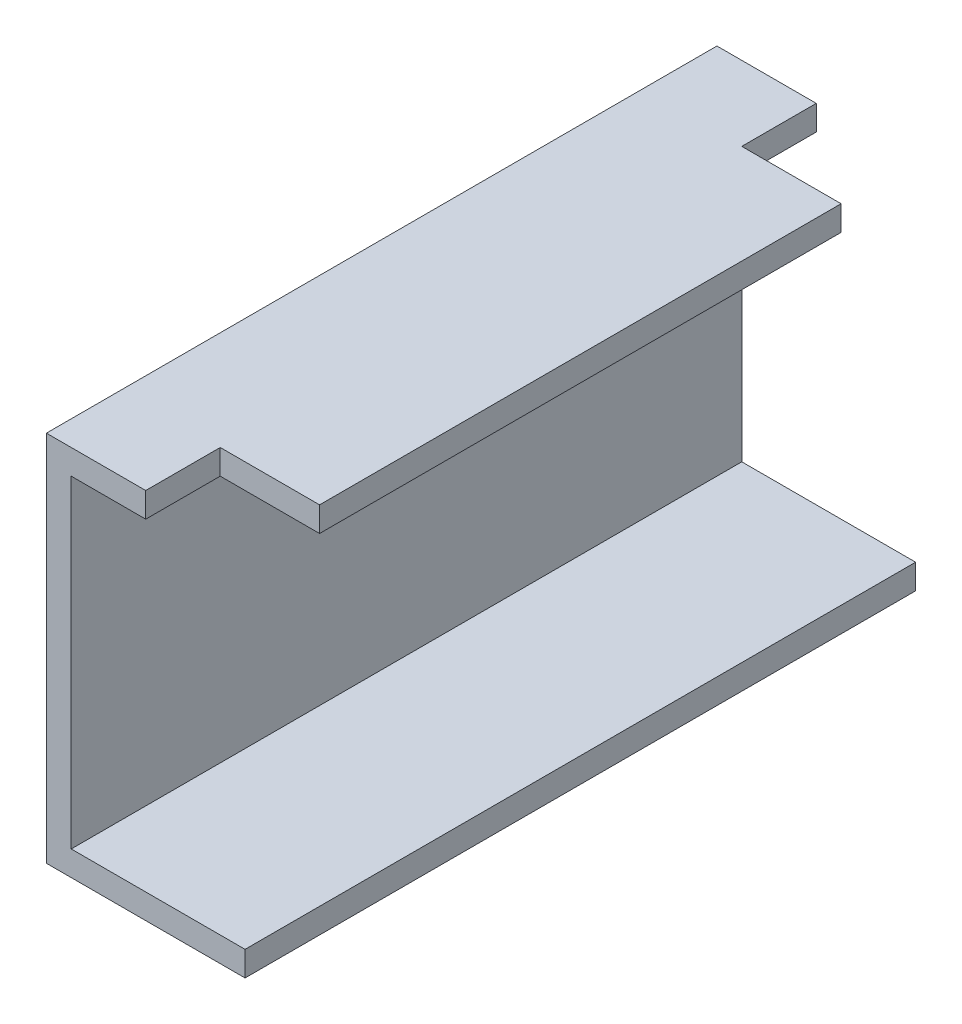
ISO-10303-21;
HEADER;
FILE_DESCRIPTION(('STEP AP214'),'2;1');
FILE_NAME('part.step','',(''),(''),'','','');
FILE_SCHEMA(('AUTOMOTIVE_DESIGN { 1 0 10303 214 1 1 1 1 }'));
ENDSEC;
DATA;
#1=APPLICATION_CONTEXT('core data for automotive mechanical design processes');
#2=APPLICATION_PROTOCOL_DEFINITION('international standard','automotive_design',2000,#1);
#3=PRODUCT_CONTEXT('',#1,'mechanical');
#4=PRODUCT('Part','Part','',(#3));
#5=PRODUCT_RELATED_PRODUCT_CATEGORY('part','',(#4));
#6=PRODUCT_DEFINITION_FORMATION('','',#4);
#7=PRODUCT_DEFINITION_CONTEXT('part definition',#1,'design');
#8=PRODUCT_DEFINITION('design','',#6,#7);
#9=PRODUCT_DEFINITION_SHAPE('','',#8);
#10=(LENGTH_UNIT() NAMED_UNIT(*) SI_UNIT(.MILLI.,.METRE.));
#11=(NAMED_UNIT(*) PLANE_ANGLE_UNIT() SI_UNIT($,.RADIAN.));
#12=(NAMED_UNIT(*) SI_UNIT($,.STERADIAN.) SOLID_ANGLE_UNIT());
#13=UNCERTAINTY_MEASURE_WITH_UNIT(LENGTH_MEASURE(1.E-05),#10,'distance_accuracy_value','');
#14=(GEOMETRIC_REPRESENTATION_CONTEXT(3) GLOBAL_UNCERTAINTY_ASSIGNED_CONTEXT((#13)) GLOBAL_UNIT_ASSIGNED_CONTEXT((#10,
#11,#12)) REPRESENTATION_CONTEXT('',''));
#15=CARTESIAN_POINT('',(0.,0.,0.));
#16=DIRECTION('',(0.,0.,1.));
#17=DIRECTION('',(1.,0.,0.));
#18=AXIS2_PLACEMENT_3D('',#15,#16,#17);
#19=CARTESIAN_POINT('',(-1.1,0.0499999999999997,-0.675));
#20=DIRECTION('',(0.,-1.,0.));
#21=DIRECTION('',(0.,0.,-1.));
#22=AXIS2_PLACEMENT_3D('',#19,#20,#21);
#23=PLANE('',#22);
#24=DIRECTION('',(0.,0.,1.));
#25=VECTOR('',#24,1.);
#26=CARTESIAN_POINT('',(-0.75,0.0499999999999997,-0.675));
#27=LINE('',#26,#25);
#28=CARTESIAN_POINT('',(-0.75,0.0500000000000004,-0.675));
#29=VERTEX_POINT('',#28);
#30=CARTESIAN_POINT('',(-0.75,0.0499999999999997,0.675000000000001));
#31=VERTEX_POINT('',#30);
#32=EDGE_CURVE('E11',#29,#31,#27,.T.);
#33=ORIENTED_EDGE('',*,*,#32,.F.);
#34=DIRECTION('',(1.,0.,0.));
#35=VECTOR('',#34,1.);
#36=CARTESIAN_POINT('',(-1.1,0.0500000000000003,-0.675));
#37=LINE('',#36,#35);
#38=CARTESIAN_POINT('',(-1.1,0.0500000000000003,-0.675));
#39=VERTEX_POINT('',#38);
#40=EDGE_CURVE('E24',#39,#29,#37,.T.);
#41=ORIENTED_EDGE('',*,*,#40,.F.);
#42=DIRECTION('',(0.,0.,-1.));
#43=VECTOR('',#42,1.);
#44=CARTESIAN_POINT('',(-1.1,0.0499999999999997,-0.675));
#45=LINE('',#44,#43);
#46=CARTESIAN_POINT('',(-1.1,0.05,0.675));
#47=VERTEX_POINT('',#46);
#48=EDGE_CURVE('E203',#47,#39,#45,.T.);
#49=ORIENTED_EDGE('',*,*,#48,.F.);
#50=DIRECTION('',(1.,0.,0.));
#51=VECTOR('',#50,1.);
#52=CARTESIAN_POINT('',(-1.1,0.05,0.675));
#53=LINE('',#52,#51);
#54=EDGE_CURVE('E201',#47,#31,#53,.T.);
#55=ORIENTED_EDGE('',*,*,#54,.T.);
#56=EDGE_LOOP('',(#33,#41,#49,#55));
#57=FACE_BOUND('',#56,.T.);
#58=ADVANCED_FACE('F17',(#57),#23,.F.);
#59=CARTESIAN_POINT('',(-1.15,0.,0.675));
#60=DIRECTION('',(0.,1.,0.));
#61=DIRECTION('',(0.,0.,1.));
#62=AXIS2_PLACEMENT_3D('',#59,#60,#61);
#63=PLANE('',#62);
#64=DIRECTION('',(0.,0.,-1.));
#65=VECTOR('',#64,1.);
#66=CARTESIAN_POINT('',(-0.75,0.,0.675));
#67=LINE('',#66,#65);
#68=CARTESIAN_POINT('',(-0.75,0.,0.675));
#69=VERTEX_POINT('',#68);
#70=CARTESIAN_POINT('',(-0.75,0.,-0.675));
#71=VERTEX_POINT('',#70);
#72=EDGE_CURVE('E199',#69,#71,#67,.T.);
#73=ORIENTED_EDGE('',*,*,#72,.F.);
#74=DIRECTION('',(1.,0.,0.));
#75=VECTOR('',#74,1.);
#76=CARTESIAN_POINT('',(-1.15,0.,0.675));
#77=LINE('',#76,#75);
#78=CARTESIAN_POINT('',(-1.15,0.,0.675));
#79=VERTEX_POINT('',#78);
#80=EDGE_CURVE('E196',#79,#69,#77,.T.);
#81=ORIENTED_EDGE('',*,*,#80,.F.);
#82=DIRECTION('',(0.,0.,1.));
#83=VECTOR('',#82,1.);
#84=CARTESIAN_POINT('',(-1.15,0.,0.675));
#85=LINE('',#84,#83);
#86=CARTESIAN_POINT('',(-1.15,0.,-0.675));
#87=VERTEX_POINT('',#86);
#88=EDGE_CURVE('E193',#87,#79,#85,.T.);
#89=ORIENTED_EDGE('',*,*,#88,.F.);
#90=DIRECTION('',(1.,0.,0.));
#91=VECTOR('',#90,1.);
#92=CARTESIAN_POINT('',(-1.15,0.,-0.675));
#93=LINE('',#92,#91);
#94=EDGE_CURVE('E190',#87,#71,#93,.T.);
#95=ORIENTED_EDGE('',*,*,#94,.T.);
#96=EDGE_LOOP('',(#73,#81,#89,#95));
#97=FACE_BOUND('',#96,.T.);
#98=ADVANCED_FACE('F213',(#97),#63,.F.);
#99=CARTESIAN_POINT('',(-1.1,0.7,-0.675));
#100=DIRECTION('',(1.,0.,0.));
#101=DIRECTION('',(0.,0.,-1.));
#102=AXIS2_PLACEMENT_3D('',#99,#100,#101);
#103=PLANE('',#102);
#104=DIRECTION('',(0.,-1.,0.));
#105=VECTOR('',#104,1.);
#106=CARTESIAN_POINT('',(-1.1,0.7,0.675));
#107=LINE('',#106,#105);
#108=CARTESIAN_POINT('',(-1.1,0.7,0.675));
#109=VERTEX_POINT('',#108);
#110=EDGE_CURVE('E187',#109,#47,#107,.T.);
#111=ORIENTED_EDGE('',*,*,#110,.T.);
#112=ORIENTED_EDGE('',*,*,#48,.T.);
#113=DIRECTION('',(0.,-1.,0.));
#114=VECTOR('',#113,1.);
#115=CARTESIAN_POINT('',(-1.1,0.7,-0.675));
#116=LINE('',#115,#114);
#117=CARTESIAN_POINT('',(-1.1,0.7,-0.675));
#118=VERTEX_POINT('',#117);
#119=EDGE_CURVE('E184',#118,#39,#116,.T.);
#120=ORIENTED_EDGE('',*,*,#119,.F.);
#121=DIRECTION('',(0.,0.,1.));
#122=VECTOR('',#121,1.);
#123=CARTESIAN_POINT('',(-1.1,0.7,-0.675));
#124=LINE('',#123,#122);
#125=EDGE_CURVE('E181',#118,#109,#124,.T.);
#126=ORIENTED_EDGE('',*,*,#125,.T.);
#127=EDGE_LOOP('',(#111,#112,#120,#126));
#128=FACE_BOUND('',#127,.T.);
#129=ADVANCED_FACE('F223',(#128),#103,.T.);
#130=CARTESIAN_POINT('',(-1.15,0.75,0.675));
#131=DIRECTION('',(-1.,0.,0.));
#132=DIRECTION('',(0.,0.,1.));
#133=AXIS2_PLACEMENT_3D('',#130,#131,#132);
#134=PLANE('',#133);
#135=DIRECTION('',(0.,-1.,0.));
#136=VECTOR('',#135,1.);
#137=CARTESIAN_POINT('',(-1.15,0.75,-0.675));
#138=LINE('',#137,#136);
#139=CARTESIAN_POINT('',(-1.15,0.75,-0.675));
#140=VERTEX_POINT('',#139);
#141=EDGE_CURVE('E178',#140,#87,#138,.T.);
#142=ORIENTED_EDGE('',*,*,#141,.T.);
#143=ORIENTED_EDGE('',*,*,#88,.T.);
#144=DIRECTION('',(0.,-1.,0.));
#145=VECTOR('',#144,1.);
#146=CARTESIAN_POINT('',(-1.15,0.750000000000001,0.675));
#147=LINE('',#146,#145);
#148=CARTESIAN_POINT('',(-1.15,0.750000000000001,0.675));
#149=VERTEX_POINT('',#148);
#150=EDGE_CURVE('E175',#149,#79,#147,.T.);
#151=ORIENTED_EDGE('',*,*,#150,.F.);
#152=DIRECTION('',(0.,0.,-1.));
#153=VECTOR('',#152,1.);
#154=CARTESIAN_POINT('',(-1.15,0.75,0.675));
#155=LINE('',#154,#153);
#156=EDGE_CURVE('E172',#149,#140,#155,.T.);
#157=ORIENTED_EDGE('',*,*,#156,.T.);
#158=EDGE_LOOP('',(#142,#143,#151,#157));
#159=FACE_BOUND('',#158,.T.);
#160=ADVANCED_FACE('F215',(#159),#134,.T.);
#161=CARTESIAN_POINT('',(-2.47592560861063,0.700000000000001,-0.675));
#162=DIRECTION('',(0.,1.,0.));
#163=DIRECTION('',(-1.,0.,0.));
#164=AXIS2_PLACEMENT_3D('',#161,#162,#163);
#165=PLANE('',#164);
#166=DIRECTION('',(0.,0.,1.));
#167=VECTOR('',#166,1.);
#168=CARTESIAN_POINT('',(-0.75,0.7,-0.675));
#169=LINE('',#168,#167);
#170=CARTESIAN_POINT('',(-0.75,0.7,-0.525));
#171=VERTEX_POINT('',#170);
#172=CARTESIAN_POINT('',(-0.75,0.7,0.525));
#173=VERTEX_POINT('',#172);
#174=EDGE_CURVE('E170',#171,#173,#169,.T.);
#175=ORIENTED_EDGE('',*,*,#174,.T.);
#176=DIRECTION('',(1.,0.,0.));
#177=VECTOR('',#176,1.);
#178=CARTESIAN_POINT('',(-0.75,0.7,0.525));
#179=LINE('',#178,#177);
#180=CARTESIAN_POINT('',(-0.95,0.7,0.525));
#181=VERTEX_POINT('',#180);
#182=EDGE_CURVE('E167',#181,#173,#179,.T.);
#183=ORIENTED_EDGE('',*,*,#182,.F.);
#184=DIRECTION('',(0.,0.,-1.));
#185=VECTOR('',#184,1.);
#186=CARTESIAN_POINT('',(-0.95,0.7,0.675));
#187=LINE('',#186,#185);
#188=CARTESIAN_POINT('',(-0.95,0.7,0.675));
#189=VERTEX_POINT('',#188);
#190=EDGE_CURVE('E164',#189,#181,#187,.T.);
#191=ORIENTED_EDGE('',*,*,#190,.F.);
#192=DIRECTION('',(1.,0.,0.));
#193=VECTOR('',#192,1.);
#194=CARTESIAN_POINT('',(-2.47592560861063,0.700000000000001,0.675));
#195=LINE('',#194,#193);
#196=EDGE_CURVE('E161',#109,#189,#195,.T.);
#197=ORIENTED_EDGE('',*,*,#196,.F.);
#198=ORIENTED_EDGE('',*,*,#125,.F.);
#199=DIRECTION('',(1.,0.,0.));
#200=VECTOR('',#199,1.);
#201=CARTESIAN_POINT('',(-2.47592560861063,0.700000000000001,-0.675));
#202=LINE('',#201,#200);
#203=CARTESIAN_POINT('',(-0.95,0.7,-0.675));
#204=VERTEX_POINT('',#203);
#205=EDGE_CURVE('E159',#118,#204,#202,.T.);
#206=ORIENTED_EDGE('',*,*,#205,.T.);
#207=DIRECTION('',(0.,0.,-1.));
#208=VECTOR('',#207,1.);
#209=CARTESIAN_POINT('',(-0.95,0.7,-0.675));
#210=LINE('',#209,#208);
#211=CARTESIAN_POINT('',(-0.95,0.7,-0.525));
#212=VERTEX_POINT('',#211);
#213=EDGE_CURVE('E157',#212,#204,#210,.T.);
#214=ORIENTED_EDGE('',*,*,#213,.F.);
#215=DIRECTION('',(-1.,0.,0.));
#216=VECTOR('',#215,1.);
#217=CARTESIAN_POINT('',(-0.75,0.7,-0.525));
#218=LINE('',#217,#216);
#219=EDGE_CURVE('E127',#171,#212,#218,.T.);
#220=ORIENTED_EDGE('',*,*,#219,.F.);
#221=EDGE_LOOP('',(#175,#183,#191,#197,#198,#206,#214,#220));
#222=FACE_BOUND('',#221,.T.);
#223=ADVANCED_FACE('F220',(#222),#165,.F.);
#224=CARTESIAN_POINT('',(-2.47592560861063,0.750000000000001,-0.675));
#225=DIRECTION('',(0.,0.,1.));
#226=DIRECTION('',(1.,0.,0.));
#227=AXIS2_PLACEMENT_3D('',#224,#225,#226);
#228=PLANE('',#227);
#229=DIRECTION('',(1.,0.,0.));
#230=VECTOR('',#229,1.);
#231=CARTESIAN_POINT('',(-2.47592560861063,0.750000000000001,-0.675));
#232=LINE('',#231,#230);
#233=CARTESIAN_POINT('',(-0.95,0.75,-0.675));
#234=VERTEX_POINT('',#233);
#235=EDGE_CURVE('E154',#140,#234,#232,.T.);
#236=ORIENTED_EDGE('',*,*,#235,.T.);
#237=DIRECTION('',(0.,1.,0.));
#238=VECTOR('',#237,1.);
#239=CARTESIAN_POINT('',(-0.95,-0.00100000000000057,-0.675));
#240=LINE('',#239,#238);
#241=EDGE_CURVE('E121',#204,#234,#240,.T.);
#242=ORIENTED_EDGE('',*,*,#241,.F.);
#243=ORIENTED_EDGE('',*,*,#205,.F.);
#244=ORIENTED_EDGE('',*,*,#119,.T.);
#245=ORIENTED_EDGE('',*,*,#40,.T.);
#246=DIRECTION('',(0.,1.,0.));
#247=VECTOR('',#246,1.);
#248=CARTESIAN_POINT('',(-0.75,0.375,-0.675));
#249=LINE('',#248,#247);
#250=EDGE_CURVE('E151',#71,#29,#249,.T.);
#251=ORIENTED_EDGE('',*,*,#250,.F.);
#252=ORIENTED_EDGE('',*,*,#94,.F.);
#253=ORIENTED_EDGE('',*,*,#141,.F.);
#254=EDGE_LOOP('',(#236,#242,#243,#244,#245,#251,#252,#253));
#255=FACE_BOUND('',#254,.T.);
#256=ADVANCED_FACE('F207',(#255),#228,.F.);
#257=CARTESIAN_POINT('',(-2.47592560861063,0.750000000000001,0.675));
#258=DIRECTION('',(0.,-1.,0.));
#259=DIRECTION('',(1.,0.,0.));
#260=AXIS2_PLACEMENT_3D('',#257,#258,#259);
#261=PLANE('',#260);
#262=DIRECTION('',(0.,0.,1.));
#263=VECTOR('',#262,1.);
#264=CARTESIAN_POINT('',(-0.95,0.75,0.675));
#265=LINE('',#264,#263);
#266=CARTESIAN_POINT('',(-0.95,0.75,0.525));
#267=VERTEX_POINT('',#266);
#268=CARTESIAN_POINT('',(-0.95,0.75,0.675));
#269=VERTEX_POINT('',#268);
#270=EDGE_CURVE('E149',#267,#269,#265,.T.);
#271=ORIENTED_EDGE('',*,*,#270,.F.);
#272=DIRECTION('',(-1.,0.,0.));
#273=VECTOR('',#272,1.);
#274=CARTESIAN_POINT('',(-0.75,0.75,0.525));
#275=LINE('',#274,#273);
#276=CARTESIAN_POINT('',(-0.75,0.75,0.525));
#277=VERTEX_POINT('',#276);
#278=EDGE_CURVE('E146',#277,#267,#275,.T.);
#279=ORIENTED_EDGE('',*,*,#278,.F.);
#280=DIRECTION('',(0.,0.,-1.));
#281=VECTOR('',#280,1.);
#282=CARTESIAN_POINT('',(-0.75,0.75,0.675));
#283=LINE('',#282,#281);
#284=CARTESIAN_POINT('',(-0.75,0.75,-0.525));
#285=VERTEX_POINT('',#284);
#286=EDGE_CURVE('E108',#277,#285,#283,.T.);
#287=ORIENTED_EDGE('',*,*,#286,.T.);
#288=DIRECTION('',(1.,0.,0.));
#289=VECTOR('',#288,1.);
#290=CARTESIAN_POINT('',(-0.75,0.75,-0.525));
#291=LINE('',#290,#289);
#292=CARTESIAN_POINT('',(-0.95,0.75,-0.525));
#293=VERTEX_POINT('',#292);
#294=EDGE_CURVE('E102',#293,#285,#291,.T.);
#295=ORIENTED_EDGE('',*,*,#294,.F.);
#296=DIRECTION('',(0.,0.,1.));
#297=VECTOR('',#296,1.);
#298=CARTESIAN_POINT('',(-0.95,0.75,-0.675));
#299=LINE('',#298,#297);
#300=EDGE_CURVE('E106',#234,#293,#299,.T.);
#301=ORIENTED_EDGE('',*,*,#300,.F.);
#302=ORIENTED_EDGE('',*,*,#235,.F.);
#303=ORIENTED_EDGE('',*,*,#156,.F.);
#304=DIRECTION('',(1.,0.,0.));
#305=VECTOR('',#304,1.);
#306=CARTESIAN_POINT('',(-2.47592560861063,0.750000000000001,0.675));
#307=LINE('',#306,#305);
#308=EDGE_CURVE('E122',#149,#269,#307,.T.);
#309=ORIENTED_EDGE('',*,*,#308,.T.);
#310=EDGE_LOOP('',(#271,#279,#287,#295,#301,#302,#303,#309));
#311=FACE_BOUND('',#310,.T.);
#312=ADVANCED_FACE('F104',(#311),#261,.F.);
#313=CARTESIAN_POINT('',(-2.47592560861063,0.700000000000001,0.675));
#314=DIRECTION('',(0.,0.,-1.));
#315=DIRECTION('',(0.,1.,0.));
#316=AXIS2_PLACEMENT_3D('',#313,#314,#315);
#317=PLANE('',#316);
#318=ORIENTED_EDGE('',*,*,#196,.T.);
#319=DIRECTION('',(0.,1.,0.));
#320=VECTOR('',#319,1.);
#321=CARTESIAN_POINT('',(-0.95,-0.00100000000000057,0.675));
#322=LINE('',#321,#320);
#323=EDGE_CURVE('E140',#189,#269,#322,.T.);
#324=ORIENTED_EDGE('',*,*,#323,.T.);
#325=ORIENTED_EDGE('',*,*,#308,.F.);
#326=ORIENTED_EDGE('',*,*,#150,.T.);
#327=ORIENTED_EDGE('',*,*,#80,.T.);
#328=DIRECTION('',(0.,-1.,0.));
#329=VECTOR('',#328,1.);
#330=CARTESIAN_POINT('',(-0.75,0.375,0.675000000000001));
#331=LINE('',#330,#329);
#332=EDGE_CURVE('E138',#31,#69,#331,.T.);
#333=ORIENTED_EDGE('',*,*,#332,.F.);
#334=ORIENTED_EDGE('',*,*,#54,.F.);
#335=ORIENTED_EDGE('',*,*,#110,.F.);
#336=EDGE_LOOP('',(#318,#324,#325,#326,#327,#333,#334,#335));
#337=FACE_BOUND('',#336,.T.);
#338=ADVANCED_FACE('F226',(#337),#317,.F.);
#339=CARTESIAN_POINT('',(-0.75,0.75,0.675));
#340=DIRECTION('',(-1.,0.,0.));
#341=DIRECTION('',(0.,0.,1.));
#342=AXIS2_PLACEMENT_3D('',#339,#340,#341);
#343=PLANE('',#342);
#344=ORIENTED_EDGE('',*,*,#286,.F.);
#345=DIRECTION('',(0.,1.,0.));
#346=VECTOR('',#345,1.);
#347=CARTESIAN_POINT('',(-0.75,-0.00100000000000057,0.525));
#348=LINE('',#347,#346);
#349=EDGE_CURVE('E131',#173,#277,#348,.T.);
#350=ORIENTED_EDGE('',*,*,#349,.F.);
#351=ORIENTED_EDGE('',*,*,#174,.F.);
#352=DIRECTION('',(0.,1.,0.));
#353=VECTOR('',#352,1.);
#354=CARTESIAN_POINT('',(-0.75,-0.00100000000000057,-0.525));
#355=LINE('',#354,#353);
#356=EDGE_CURVE('E128',#171,#285,#355,.T.);
#357=ORIENTED_EDGE('',*,*,#356,.T.);
#358=EDGE_LOOP('',(#344,#350,#351,#357));
#359=FACE_BOUND('',#358,.T.);
#360=ADVANCED_FACE('F235',(#359),#343,.F.);
#361=CARTESIAN_POINT('',(-0.75,0.0249999999999999,0.));
#362=DIRECTION('',(1.,0.,0.));
#363=DIRECTION('',(0.,0.,-1.));
#364=AXIS2_PLACEMENT_3D('',#361,#362,#363);
#365=PLANE('',#364);
#366=ORIENTED_EDGE('',*,*,#332,.T.);
#367=ORIENTED_EDGE('',*,*,#72,.T.);
#368=ORIENTED_EDGE('',*,*,#250,.T.);
#369=ORIENTED_EDGE('',*,*,#32,.T.);
#370=EDGE_LOOP('',(#366,#367,#368,#369));
#371=FACE_BOUND('',#370,.T.);
#372=ADVANCED_FACE('F210',(#371),#365,.T.);
#373=CARTESIAN_POINT('',(-0.95,-0.00100000000000057,-0.675));
#374=DIRECTION('',(-1.,0.,0.));
#375=DIRECTION('',(0.,-1.,0.));
#376=AXIS2_PLACEMENT_3D('',#373,#374,#375);
#377=PLANE('',#376);
#378=ORIENTED_EDGE('',*,*,#213,.T.);
#379=ORIENTED_EDGE('',*,*,#241,.T.);
#380=ORIENTED_EDGE('',*,*,#300,.T.);
#381=DIRECTION('',(0.,1.,0.));
#382=VECTOR('',#381,1.);
#383=CARTESIAN_POINT('',(-0.95,-0.00100000000000057,-0.525));
#384=LINE('',#383,#382);
#385=EDGE_CURVE('E119',#212,#293,#384,.T.);
#386=ORIENTED_EDGE('',*,*,#385,.F.);
#387=EDGE_LOOP('',(#378,#379,#380,#386));
#388=FACE_BOUND('',#387,.T.);
#389=ADVANCED_FACE('F118',(#388),#377,.F.);
#390=CARTESIAN_POINT('',(-0.75,-0.00100000000000057,-0.525));
#391=DIRECTION('',(0.,0.,1.));
#392=DIRECTION('',(0.,-1.,0.));
#393=AXIS2_PLACEMENT_3D('',#390,#391,#392);
#394=PLANE('',#393);
#395=ORIENTED_EDGE('',*,*,#219,.T.);
#396=ORIENTED_EDGE('',*,*,#385,.T.);
#397=ORIENTED_EDGE('',*,*,#294,.T.);
#398=ORIENTED_EDGE('',*,*,#356,.F.);
#399=EDGE_LOOP('',(#395,#396,#397,#398));
#400=FACE_BOUND('',#399,.T.);
#401=ADVANCED_FACE('F125',(#400),#394,.F.);
#402=CARTESIAN_POINT('',(-0.75,-0.00100000000000057,0.525));
#403=DIRECTION('',(0.,0.,-1.));
#404=DIRECTION('',(0.,1.,0.));
#405=AXIS2_PLACEMENT_3D('',#402,#403,#404);
#406=PLANE('',#405);
#407=ORIENTED_EDGE('',*,*,#182,.T.);
#408=ORIENTED_EDGE('',*,*,#349,.T.);
#409=ORIENTED_EDGE('',*,*,#278,.T.);
#410=DIRECTION('',(0.,1.,0.));
#411=VECTOR('',#410,1.);
#412=CARTESIAN_POINT('',(-0.95,-0.00100000000000057,0.525));
#413=LINE('',#412,#411);
#414=EDGE_CURVE('E129',#181,#267,#413,.T.);
#415=ORIENTED_EDGE('',*,*,#414,.F.);
#416=EDGE_LOOP('',(#407,#408,#409,#415));
#417=FACE_BOUND('',#416,.T.);
#418=ADVANCED_FACE('F231',(#417),#406,.F.);
#419=CARTESIAN_POINT('',(-0.95,-0.00100000000000057,0.675));
#420=DIRECTION('',(-1.,0.,0.));
#421=DIRECTION('',(0.,-1.,0.));
#422=AXIS2_PLACEMENT_3D('',#419,#420,#421);
#423=PLANE('',#422);
#424=ORIENTED_EDGE('',*,*,#190,.T.);
#425=ORIENTED_EDGE('',*,*,#414,.T.);
#426=ORIENTED_EDGE('',*,*,#270,.T.);
#427=ORIENTED_EDGE('',*,*,#323,.F.);
#428=EDGE_LOOP('',(#424,#425,#426,#427));
#429=FACE_BOUND('',#428,.T.);
#430=ADVANCED_FACE('F233',(#429),#423,.F.);
#431=CLOSED_SHELL('',(#58,#98,#129,#160,#223,#256,#312,#338,#360,#372,#389,#401,#418,#430));
#432=MANIFOLD_SOLID_BREP('B1',#431);
#433=ADVANCED_BREP_SHAPE_REPRESENTATION('',(#18,#432),#14);
#434=SHAPE_DEFINITION_REPRESENTATION(#9,#433);
ENDSEC;
END-ISO-10303-21;
